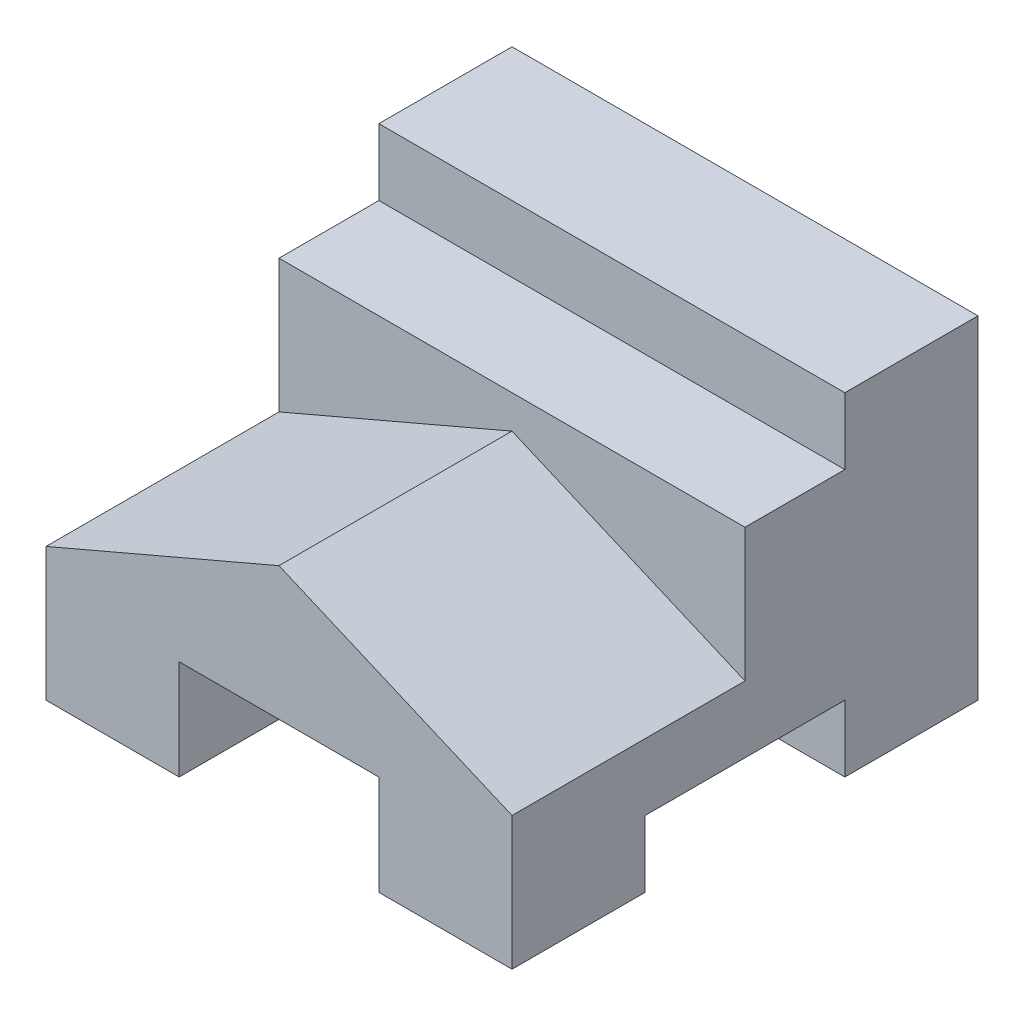
ISO-10303-21;
HEADER;
FILE_DESCRIPTION(('STEP AP214'),'2;1');
FILE_NAME('part.step','',(''),(''),'','','');
FILE_SCHEMA(('AUTOMOTIVE_DESIGN { 1 0 10303 214 1 1 1 1 }'));
ENDSEC;
DATA;
#1=APPLICATION_CONTEXT('core data for automotive mechanical design processes');
#2=APPLICATION_PROTOCOL_DEFINITION('international standard','automotive_design',2000,#1);
#3=PRODUCT_CONTEXT('',#1,'mechanical');
#4=PRODUCT('Part','Part','',(#3));
#5=PRODUCT_RELATED_PRODUCT_CATEGORY('part','',(#4));
#6=PRODUCT_DEFINITION_FORMATION('','',#4);
#7=PRODUCT_DEFINITION_CONTEXT('part definition',#1,'design');
#8=PRODUCT_DEFINITION('design','',#6,#7);
#9=PRODUCT_DEFINITION_SHAPE('','',#8);
#10=(LENGTH_UNIT() NAMED_UNIT(*) SI_UNIT(.MILLI.,.METRE.));
#11=(NAMED_UNIT(*) PLANE_ANGLE_UNIT() SI_UNIT($,.RADIAN.));
#12=(NAMED_UNIT(*) SI_UNIT($,.STERADIAN.) SOLID_ANGLE_UNIT());
#13=UNCERTAINTY_MEASURE_WITH_UNIT(LENGTH_MEASURE(1.E-05),#10,'distance_accuracy_value','');
#14=(GEOMETRIC_REPRESENTATION_CONTEXT(3) GLOBAL_UNCERTAINTY_ASSIGNED_CONTEXT((#13)) GLOBAL_UNIT_ASSIGNED_CONTEXT((#10,
#11,#12)) REPRESENTATION_CONTEXT('',''));
#15=CARTESIAN_POINT('',(0.,0.,0.));
#16=DIRECTION('',(0.,0.,1.));
#17=DIRECTION('',(1.,0.,0.));
#18=AXIS2_PLACEMENT_3D('',#15,#16,#17);
#19=CARTESIAN_POINT('',(-31.8772945789058,27.6908396946565,70.));
#20=DIRECTION('',(0.,-1.,0.));
#21=DIRECTION('',(0.,0.,-1.));
#22=AXIS2_PLACEMENT_3D('',#19,#20,#21);
#23=PLANE('',#22);
#24=DIRECTION('',(0.,0.,-1.));
#25=VECTOR('',#24,1.);
#26=CARTESIAN_POINT('',(-31.8772945789058,27.6908396946565,70.));
#27=LINE('',#26,#25);
#28=CARTESIAN_POINT('',(-31.8772945789058,27.6908396946565,20.));
#29=VERTEX_POINT('',#28);
#30=CARTESIAN_POINT('',(-31.8772945789058,27.6908396946565,0.));
#31=VERTEX_POINT('',#30);
#32=EDGE_CURVE('E195',#29,#31,#27,.T.);
#33=ORIENTED_EDGE('',*,*,#32,.F.);
#34=DIRECTION('',(-1.,0.,0.));
#35=VECTOR('',#34,1.);
#36=CARTESIAN_POINT('',(38.1227054210942,27.6908396946565,20.));
#37=LINE('',#36,#35);
#38=CARTESIAN_POINT('',(38.1227054210942,27.6908396946565,20.));
#39=VERTEX_POINT('',#38);
#40=EDGE_CURVE('E181',#39,#29,#37,.T.);
#41=ORIENTED_EDGE('',*,*,#40,.F.);
#42=DIRECTION('',(0.,0.,-1.));
#43=VECTOR('',#42,1.);
#44=CARTESIAN_POINT('',(38.1227054210942,27.6908396946565,70.));
#45=LINE('',#44,#43);
#46=CARTESIAN_POINT('',(38.1227054210942,27.6908396946565,0.));
#47=VERTEX_POINT('',#46);
#48=EDGE_CURVE('E193',#39,#47,#45,.T.);
#49=ORIENTED_EDGE('',*,*,#48,.T.);
#50=DIRECTION('',(-1.,0.,0.));
#51=VECTOR('',#50,1.);
#52=CARTESIAN_POINT('',(-31.8772945789058,27.6908396946565,0.));
#53=LINE('',#52,#51);
#54=EDGE_CURVE('E245',#47,#31,#53,.T.);
#55=ORIENTED_EDGE('',*,*,#54,.T.);
#56=EDGE_LOOP('',(#33,#41,#49,#55));
#57=FACE_BOUND('',#56,.T.);
#58=ADVANCED_FACE('F33',(#57),#23,.F.);
#59=CARTESIAN_POINT('',(-31.8772945789058,-22.3091603053435,70.));
#60=DIRECTION('',(0.,1.,0.));
#61=DIRECTION('',(0.,0.,1.));
#62=AXIS2_PLACEMENT_3D('',#59,#60,#61);
#63=PLANE('',#62);
#64=DIRECTION('',(1.,0.,0.));
#65=VECTOR('',#64,1.);
#66=CARTESIAN_POINT('',(-31.8772945789058,-22.3091603053435,0.));
#67=LINE('',#66,#65);
#68=CARTESIAN_POINT('',(-31.8772945789058,-22.3091603053435,0.));
#69=VERTEX_POINT('',#68);
#70=CARTESIAN_POINT('',(-11.8772945789058,-22.3091603053435,0.));
#71=VERTEX_POINT('',#70);
#72=EDGE_CURVE('E256',#69,#71,#67,.T.);
#73=ORIENTED_EDGE('',*,*,#72,.T.);
#74=DIRECTION('',(0.,0.,1.));
#75=VECTOR('',#74,1.);
#76=CARTESIAN_POINT('',(-11.8772945789058,-22.3091603053435,0.));
#77=LINE('',#76,#75);
#78=CARTESIAN_POINT('',(-11.8772945789058,-22.3091603053435,20.));
#79=VERTEX_POINT('',#78);
#80=EDGE_CURVE('E314',#71,#79,#77,.T.);
#81=ORIENTED_EDGE('',*,*,#80,.T.);
#82=DIRECTION('',(-1.,0.,0.));
#83=VECTOR('',#82,1.);
#84=CARTESIAN_POINT('',(38.1227054210942,-22.3091603053435,20.));
#85=LINE('',#84,#83);
#86=CARTESIAN_POINT('',(-31.8772945789058,-22.3091603053435,20.));
#87=VERTEX_POINT('',#86);
#88=EDGE_CURVE('E349',#79,#87,#85,.T.);
#89=ORIENTED_EDGE('',*,*,#88,.T.);
#90=DIRECTION('',(0.,0.,-1.));
#91=VECTOR('',#90,1.);
#92=CARTESIAN_POINT('',(-31.8772945789058,-22.3091603053435,70.));
#93=LINE('',#92,#91);
#94=EDGE_CURVE('E211',#87,#69,#93,.T.);
#95=ORIENTED_EDGE('',*,*,#94,.T.);
#96=EDGE_LOOP('',(#73,#81,#89,#95));
#97=FACE_BOUND('',#96,.T.);
#98=ADVANCED_FACE('F388',(#97),#63,.F.);
#99=DIRECTION('',(-1.,0.,0.));
#100=VECTOR('',#99,1.);
#101=CARTESIAN_POINT('',(38.1227054210942,-22.3091603053435,50.));
#102=LINE('',#101,#100);
#103=CARTESIAN_POINT('',(-11.8772945789058,-22.3091603053435,50.));
#104=VERTEX_POINT('',#103);
#105=CARTESIAN_POINT('',(-31.8772945789058,-22.3091603053435,50.));
#106=VERTEX_POINT('',#105);
#107=EDGE_CURVE('E241',#104,#106,#102,.T.);
#108=ORIENTED_EDGE('',*,*,#107,.F.);
#109=CARTESIAN_POINT('',(-11.8772945789058,-22.3091603053435,70.));
#110=VERTEX_POINT('',#109);
#111=EDGE_CURVE('E317',#104,#110,#77,.T.);
#112=ORIENTED_EDGE('',*,*,#111,.T.);
#113=DIRECTION('',(1.,0.,0.));
#114=VECTOR('',#113,1.);
#115=CARTESIAN_POINT('',(-31.8772945789058,-22.3091603053435,70.));
#116=LINE('',#115,#114);
#117=CARTESIAN_POINT('',(-31.8772945789058,-22.3091603053435,70.));
#118=VERTEX_POINT('',#117);
#119=EDGE_CURVE('E246',#118,#110,#116,.T.);
#120=ORIENTED_EDGE('',*,*,#119,.F.);
#121=EDGE_CURVE('E212',#118,#106,#93,.T.);
#122=ORIENTED_EDGE('',*,*,#121,.T.);
#123=EDGE_LOOP('',(#108,#112,#120,#122));
#124=FACE_BOUND('',#123,.T.);
#125=ADVANCED_FACE('F378',(#124),#63,.F.);
#126=CARTESIAN_POINT('',(38.1227054210942,-22.3091603053435,20.));
#127=DIRECTION('',(0.,0.,-1.));
#128=DIRECTION('',(-1.,0.,0.));
#129=AXIS2_PLACEMENT_3D('',#126,#127,#128);
#130=PLANE('',#129);
#131=ORIENTED_EDGE('',*,*,#88,.F.);
#132=DIRECTION('',(0.,1.,0.));
#133=VECTOR('',#132,1.);
#134=CARTESIAN_POINT('',(-11.8772945789058,-22.3091603053435,20.));
#135=LINE('',#134,#133);
#136=CARTESIAN_POINT('',(-11.8772945789058,-12.3091603053435,20.));
#137=VERTEX_POINT('',#136);
#138=EDGE_CURVE('E331',#79,#137,#135,.T.);
#139=ORIENTED_EDGE('',*,*,#138,.T.);
#140=DIRECTION('',(-1.,0.,0.));
#141=VECTOR('',#140,1.);
#142=CARTESIAN_POINT('',(38.1227054210942,-12.3091603053435,20.));
#143=LINE('',#142,#141);
#144=CARTESIAN_POINT('',(-31.8772945789058,-12.3091603053435,20.));
#145=VERTEX_POINT('',#144);
#146=EDGE_CURVE('E233',#137,#145,#143,.T.);
#147=ORIENTED_EDGE('',*,*,#146,.T.);
#148=DIRECTION('',(0.,-1.,0.));
#149=VECTOR('',#148,1.);
#150=CARTESIAN_POINT('',(-31.8772945789058,-22.3091603053435,20.));
#151=LINE('',#150,#149);
#152=EDGE_CURVE('E337',#145,#87,#151,.T.);
#153=ORIENTED_EDGE('',*,*,#152,.T.);
#154=EDGE_LOOP('',(#131,#139,#147,#153));
#155=FACE_BOUND('',#154,.T.);
#156=ADVANCED_FACE('F390',(#155),#130,.F.);
#157=CARTESIAN_POINT('',(38.1227054210942,-12.3091603053435,20.));
#158=DIRECTION('',(0.,1.,0.));
#159=DIRECTION('',(0.,0.,1.));
#160=AXIS2_PLACEMENT_3D('',#157,#158,#159);
#161=PLANE('',#160);
#162=ORIENTED_EDGE('',*,*,#146,.F.);
#163=DIRECTION('',(0.,0.,1.));
#164=VECTOR('',#163,1.);
#165=CARTESIAN_POINT('',(-11.8772945789058,-12.3091603053435,20.));
#166=LINE('',#165,#164);
#167=CARTESIAN_POINT('',(-11.8772945789058,-12.3091603053435,50.));
#168=VERTEX_POINT('',#167);
#169=EDGE_CURVE('E328',#137,#168,#166,.T.);
#170=ORIENTED_EDGE('',*,*,#169,.T.);
#171=DIRECTION('',(-1.,0.,0.));
#172=VECTOR('',#171,1.);
#173=CARTESIAN_POINT('',(38.1227054210942,-12.3091603053435,50.));
#174=LINE('',#173,#172);
#175=CARTESIAN_POINT('',(-31.8772945789058,-12.3091603053435,50.));
#176=VERTEX_POINT('',#175);
#177=EDGE_CURVE('E234',#168,#176,#174,.T.);
#178=ORIENTED_EDGE('',*,*,#177,.T.);
#179=DIRECTION('',(0.,0.,-1.));
#180=VECTOR('',#179,1.);
#181=CARTESIAN_POINT('',(-31.8772945789058,-12.3091603053435,20.));
#182=LINE('',#181,#180);
#183=EDGE_CURVE('E344',#176,#145,#182,.T.);
#184=ORIENTED_EDGE('',*,*,#183,.T.);
#185=EDGE_LOOP('',(#162,#170,#178,#184));
#186=FACE_BOUND('',#185,.T.);
#187=ADVANCED_FACE('F383',(#186),#161,.F.);
#188=CARTESIAN_POINT('',(38.1227054210942,-12.3091603053435,50.));
#189=DIRECTION('',(0.,0.,1.));
#190=DIRECTION('',(1.,0.,0.));
#191=AXIS2_PLACEMENT_3D('',#188,#189,#190);
#192=PLANE('',#191);
#193=ORIENTED_EDGE('',*,*,#177,.F.);
#194=DIRECTION('',(0.,-1.,0.));
#195=VECTOR('',#194,1.);
#196=CARTESIAN_POINT('',(-11.8772945789058,-12.3091603053435,50.));
#197=LINE('',#196,#195);
#198=EDGE_CURVE('E11',#168,#104,#197,.T.);
#199=ORIENTED_EDGE('',*,*,#198,.T.);
#200=ORIENTED_EDGE('',*,*,#107,.T.);
#201=DIRECTION('',(0.,1.,0.));
#202=VECTOR('',#201,1.);
#203=CARTESIAN_POINT('',(-31.8772945789058,-12.3091603053435,50.));
#204=LINE('',#203,#202);
#205=EDGE_CURVE('E334',#106,#176,#204,.T.);
#206=ORIENTED_EDGE('',*,*,#205,.T.);
#207=EDGE_LOOP('',(#193,#199,#200,#206));
#208=FACE_BOUND('',#207,.T.);
#209=ADVANCED_FACE('F377',(#208),#192,.F.);
#210=CARTESIAN_POINT('',(38.1227054210942,-22.3091603053435,20.));
#211=VERTEX_POINT('',#210);
#212=CARTESIAN_POINT('',(18.1227054210942,-22.3091603053435,20.));
#213=VERTEX_POINT('',#212);
#214=EDGE_CURVE('E255',#211,#213,#85,.T.);
#215=ORIENTED_EDGE('',*,*,#214,.T.);
#216=DIRECTION('',(0.,0.,1.));
#217=VECTOR('',#216,1.);
#218=CARTESIAN_POINT('',(18.1227054210942,-22.3091603053435,0.));
#219=LINE('',#218,#217);
#220=CARTESIAN_POINT('',(18.1227054210942,-22.3091603053435,0.));
#221=VERTEX_POINT('',#220);
#222=EDGE_CURVE('E322',#221,#213,#219,.T.);
#223=ORIENTED_EDGE('',*,*,#222,.F.);
#224=CARTESIAN_POINT('',(38.1227054210942,-22.3091603053435,0.));
#225=VERTEX_POINT('',#224);
#226=EDGE_CURVE('E254',#221,#225,#67,.T.);
#227=ORIENTED_EDGE('',*,*,#226,.T.);
#228=DIRECTION('',(0.,0.,-1.));
#229=VECTOR('',#228,1.);
#230=CARTESIAN_POINT('',(38.1227054210942,-22.3091603053435,70.));
#231=LINE('',#230,#229);
#232=EDGE_CURVE('E202',#211,#225,#231,.T.);
#233=ORIENTED_EDGE('',*,*,#232,.F.);
#234=EDGE_LOOP('',(#215,#223,#227,#233));
#235=FACE_BOUND('',#234,.T.);
#236=ADVANCED_FACE('F375',(#235),#63,.F.);
#237=CARTESIAN_POINT('',(-31.8772945789058,27.6908396946565,70.));
#238=DIRECTION('',(1.,0.,0.));
#239=DIRECTION('',(0.,0.,-1.));
#240=AXIS2_PLACEMENT_3D('',#237,#238,#239);
#241=PLANE('',#240);
#242=DIRECTION('',(0.,-1.,0.));
#243=VECTOR('',#242,1.);
#244=CARTESIAN_POINT('',(-31.8772945789058,-2.30916030534351,35.));
#245=LINE('',#244,#243);
#246=CARTESIAN_POINT('',(-31.8772945789058,17.6908396946565,35.));
#247=VERTEX_POINT('',#246);
#248=CARTESIAN_POINT('',(-31.8772945789058,-2.30916030534351,35.));
#249=VERTEX_POINT('',#248);
#250=EDGE_CURVE('E281',#247,#249,#245,.T.);
#251=ORIENTED_EDGE('',*,*,#250,.F.);
#252=DIRECTION('',(0.,0.,1.));
#253=VECTOR('',#252,1.);
#254=CARTESIAN_POINT('',(-31.8772945789058,17.6908396946565,35.));
#255=LINE('',#254,#253);
#256=CARTESIAN_POINT('',(-31.8772945789058,17.6908396946565,20.));
#257=VERTEX_POINT('',#256);
#258=EDGE_CURVE('E48',#257,#247,#255,.T.);
#259=ORIENTED_EDGE('',*,*,#258,.F.);
#260=DIRECTION('',(0.,-1.,0.));
#261=VECTOR('',#260,1.);
#262=CARTESIAN_POINT('',(-31.8772945789058,17.6908396946565,20.));
#263=LINE('',#262,#261);
#264=EDGE_CURVE('E269',#29,#257,#263,.T.);
#265=ORIENTED_EDGE('',*,*,#264,.F.);
#266=ORIENTED_EDGE('',*,*,#32,.T.);
#267=DIRECTION('',(0.,-1.,0.));
#268=VECTOR('',#267,1.);
#269=CARTESIAN_POINT('',(-31.8772945789058,27.6908396946565,0.));
#270=LINE('',#269,#268);
#271=EDGE_CURVE('E251',#31,#69,#270,.T.);
#272=ORIENTED_EDGE('',*,*,#271,.T.);
#273=ORIENTED_EDGE('',*,*,#94,.F.);
#274=ORIENTED_EDGE('',*,*,#152,.F.);
#275=ORIENTED_EDGE('',*,*,#183,.F.);
#276=ORIENTED_EDGE('',*,*,#205,.F.);
#277=ORIENTED_EDGE('',*,*,#121,.F.);
#278=DIRECTION('',(0.,-1.,0.));
#279=VECTOR('',#278,1.);
#280=CARTESIAN_POINT('',(-31.8772945789058,27.6908396946565,70.));
#281=LINE('',#280,#279);
#282=CARTESIAN_POINT('',(-31.8772945789058,-2.30916030534351,70.));
#283=VERTEX_POINT('',#282);
#284=EDGE_CURVE('E242',#283,#118,#281,.T.);
#285=ORIENTED_EDGE('',*,*,#284,.F.);
#286=DIRECTION('',(0.,0.,1.));
#287=VECTOR('',#286,1.);
#288=CARTESIAN_POINT('',(-31.8772945789058,-2.30916030534351,35.));
#289=LINE('',#288,#287);
#290=EDGE_CURVE('E56',#249,#283,#289,.T.);
#291=ORIENTED_EDGE('',*,*,#290,.F.);
#292=EDGE_LOOP('',(#251,#259,#265,#266,#272,#273,#274,#275,#276,#277,#285,#291));
#293=FACE_BOUND('',#292,.T.);
#294=ADVANCED_FACE('F35',(#293),#241,.F.);
#295=CARTESIAN_POINT('',(18.1227054210942,-22.3091603053435,70.));
#296=VERTEX_POINT('',#295);
#297=CARTESIAN_POINT('',(38.1227054210942,-22.3091603053435,70.));
#298=VERTEX_POINT('',#297);
#299=EDGE_CURVE('E244',#296,#298,#116,.T.);
#300=ORIENTED_EDGE('',*,*,#299,.F.);
#301=CARTESIAN_POINT('',(18.1227054210942,-22.3091603053435,50.));
#302=VERTEX_POINT('',#301);
#303=EDGE_CURVE('E307',#302,#296,#219,.T.);
#304=ORIENTED_EDGE('',*,*,#303,.F.);
#305=CARTESIAN_POINT('',(38.1227054210942,-22.3091603053435,50.));
#306=VERTEX_POINT('',#305);
#307=EDGE_CURVE('E223',#306,#302,#102,.T.);
#308=ORIENTED_EDGE('',*,*,#307,.F.);
#309=EDGE_CURVE('E204',#298,#306,#231,.T.);
#310=ORIENTED_EDGE('',*,*,#309,.F.);
#311=EDGE_LOOP('',(#300,#304,#308,#310));
#312=FACE_BOUND('',#311,.T.);
#313=ADVANCED_FACE('F362',(#312),#63,.F.);
#314=CARTESIAN_POINT('',(38.1227054210942,27.6908396946565,70.));
#315=DIRECTION('',(-1.,0.,0.));
#316=DIRECTION('',(0.,0.,1.));
#317=AXIS2_PLACEMENT_3D('',#314,#315,#316);
#318=PLANE('',#317);
#319=DIRECTION('',(0.,-1.,0.));
#320=VECTOR('',#319,1.);
#321=CARTESIAN_POINT('',(38.1227054210942,17.6908396946565,20.));
#322=LINE('',#321,#320);
#323=CARTESIAN_POINT('',(38.1227054210942,17.6908396946565,20.));
#324=VERTEX_POINT('',#323);
#325=EDGE_CURVE('E177',#39,#324,#322,.T.);
#326=ORIENTED_EDGE('',*,*,#325,.T.);
#327=DIRECTION('',(0.,0.,1.));
#328=VECTOR('',#327,1.);
#329=CARTESIAN_POINT('',(38.1227054210942,17.6908396946565,35.));
#330=LINE('',#329,#328);
#331=CARTESIAN_POINT('',(38.1227054210942,17.6908396946565,35.));
#332=VERTEX_POINT('',#331);
#333=EDGE_CURVE('E188',#324,#332,#330,.T.);
#334=ORIENTED_EDGE('',*,*,#333,.T.);
#335=DIRECTION('',(0.,1.,0.));
#336=VECTOR('',#335,1.);
#337=CARTESIAN_POINT('',(38.1227054210942,27.6908396946565,35.));
#338=LINE('',#337,#336);
#339=CARTESIAN_POINT('',(38.1227054210942,-2.30916030534351,35.));
#340=VERTEX_POINT('',#339);
#341=EDGE_CURVE('E278',#340,#332,#338,.T.);
#342=ORIENTED_EDGE('',*,*,#341,.F.);
#343=DIRECTION('',(0.,0.,1.));
#344=VECTOR('',#343,1.);
#345=CARTESIAN_POINT('',(38.1227054210942,-2.30916030534351,35.));
#346=LINE('',#345,#344);
#347=CARTESIAN_POINT('',(38.1227054210942,-2.30916030534351,70.));
#348=VERTEX_POINT('',#347);
#349=EDGE_CURVE('E292',#340,#348,#346,.T.);
#350=ORIENTED_EDGE('',*,*,#349,.T.);
#351=DIRECTION('',(0.,1.,0.));
#352=VECTOR('',#351,1.);
#353=CARTESIAN_POINT('',(38.1227054210942,27.6908396946565,70.));
#354=LINE('',#353,#352);
#355=EDGE_CURVE('E206',#298,#348,#354,.T.);
#356=ORIENTED_EDGE('',*,*,#355,.F.);
#357=ORIENTED_EDGE('',*,*,#309,.T.);
#358=DIRECTION('',(0.,1.,0.));
#359=VECTOR('',#358,1.);
#360=CARTESIAN_POINT('',(38.1227054210942,-12.3091603053435,50.));
#361=LINE('',#360,#359);
#362=CARTESIAN_POINT('',(38.1227054210942,-12.3091603053435,50.));
#363=VERTEX_POINT('',#362);
#364=EDGE_CURVE('E335',#306,#363,#361,.T.);
#365=ORIENTED_EDGE('',*,*,#364,.T.);
#366=DIRECTION('',(0.,0.,-1.));
#367=VECTOR('',#366,1.);
#368=CARTESIAN_POINT('',(38.1227054210942,-12.3091603053435,20.));
#369=LINE('',#368,#367);
#370=CARTESIAN_POINT('',(38.1227054210942,-12.3091603053435,20.));
#371=VERTEX_POINT('',#370);
#372=EDGE_CURVE('E232',#363,#371,#369,.T.);
#373=ORIENTED_EDGE('',*,*,#372,.T.);
#374=DIRECTION('',(0.,-1.,0.));
#375=VECTOR('',#374,1.);
#376=CARTESIAN_POINT('',(38.1227054210942,-22.3091603053435,20.));
#377=LINE('',#376,#375);
#378=EDGE_CURVE('E339',#371,#211,#377,.T.);
#379=ORIENTED_EDGE('',*,*,#378,.T.);
#380=ORIENTED_EDGE('',*,*,#232,.T.);
#381=DIRECTION('',(0.,1.,0.));
#382=VECTOR('',#381,1.);
#383=CARTESIAN_POINT('',(38.1227054210942,27.6908396946565,0.));
#384=LINE('',#383,#382);
#385=EDGE_CURVE('E200',#225,#47,#384,.T.);
#386=ORIENTED_EDGE('',*,*,#385,.T.);
#387=ORIENTED_EDGE('',*,*,#48,.F.);
#388=EDGE_LOOP('',(#326,#334,#342,#350,#356,#357,#365,#373,#379,#380,#386,#387));
#389=FACE_BOUND('',#388,.T.);
#390=ADVANCED_FACE('F197',(#389),#318,.F.);
#391=CARTESIAN_POINT('',(0.,0.,70.));
#392=DIRECTION('',(0.,0.,1.));
#393=DIRECTION('',(1.,0.,0.));
#394=AXIS2_PLACEMENT_3D('',#391,#392,#393);
#395=PLANE('',#394);
#396=DIRECTION('',(0.919145030018058,-0.393919298579168,0.));
#397=VECTOR('',#396,1.);
#398=CARTESIAN_POINT('',(38.1227054210942,-2.30916030534351,70.));
#399=LINE('',#398,#397);
#400=CARTESIAN_POINT('',(3.12270542109422,12.6908396946565,70.));
#401=VERTEX_POINT('',#400);
#402=EDGE_CURVE('E282',#401,#348,#399,.T.);
#403=ORIENTED_EDGE('',*,*,#402,.F.);
#404=DIRECTION('',(0.919145030018058,0.393919298579168,0.));
#405=VECTOR('',#404,1.);
#406=CARTESIAN_POINT('',(3.12270542109422,12.6908396946565,70.));
#407=LINE('',#406,#405);
#408=EDGE_CURVE('E276',#283,#401,#407,.T.);
#409=ORIENTED_EDGE('',*,*,#408,.F.);
#410=ORIENTED_EDGE('',*,*,#284,.T.);
#411=ORIENTED_EDGE('',*,*,#119,.T.);
#412=DIRECTION('',(0.,-1.,0.));
#413=VECTOR('',#412,1.);
#414=CARTESIAN_POINT('',(-11.8772945789058,-22.3091603053435,70.));
#415=LINE('',#414,#413);
#416=CARTESIAN_POINT('',(-11.8772945789058,-7.30916030534351,70.));
#417=VERTEX_POINT('',#416);
#418=EDGE_CURVE('E303',#417,#110,#415,.T.);
#419=ORIENTED_EDGE('',*,*,#418,.F.);
#420=DIRECTION('',(-1.,0.,0.));
#421=VECTOR('',#420,1.);
#422=CARTESIAN_POINT('',(-11.8772945789058,-7.30916030534351,70.));
#423=LINE('',#422,#421);
#424=CARTESIAN_POINT('',(18.1227054210942,-7.30916030534351,70.));
#425=VERTEX_POINT('',#424);
#426=EDGE_CURVE('E310',#425,#417,#423,.T.);
#427=ORIENTED_EDGE('',*,*,#426,.F.);
#428=DIRECTION('',(0.,1.,0.));
#429=VECTOR('',#428,1.);
#430=CARTESIAN_POINT('',(18.1227054210942,-7.30916030534351,70.));
#431=LINE('',#430,#429);
#432=EDGE_CURVE('E295',#296,#425,#431,.T.);
#433=ORIENTED_EDGE('',*,*,#432,.F.);
#434=ORIENTED_EDGE('',*,*,#299,.T.);
#435=ORIENTED_EDGE('',*,*,#355,.T.);
#436=EDGE_LOOP('',(#403,#409,#410,#411,#419,#427,#433,#434,#435));
#437=FACE_BOUND('',#436,.T.);
#438=ADVANCED_FACE('F368',(#437),#395,.T.);
#439=CARTESIAN_POINT('',(0.,0.,0.));
#440=DIRECTION('',(0.,0.,1.));
#441=DIRECTION('',(1.,0.,0.));
#442=AXIS2_PLACEMENT_3D('',#439,#440,#441);
#443=PLANE('',#442);
#444=DIRECTION('',(-1.,0.,0.));
#445=VECTOR('',#444,1.);
#446=CARTESIAN_POINT('',(-11.8772945789058,-7.30916030534351,0.));
#447=LINE('',#446,#445);
#448=CARTESIAN_POINT('',(18.1227054210942,-7.30916030534351,0.));
#449=VERTEX_POINT('',#448);
#450=CARTESIAN_POINT('',(-11.8772945789058,-7.30916030534351,0.));
#451=VERTEX_POINT('',#450);
#452=EDGE_CURVE('E302',#449,#451,#447,.T.);
#453=ORIENTED_EDGE('',*,*,#452,.T.);
#454=DIRECTION('',(0.,-1.,0.));
#455=VECTOR('',#454,1.);
#456=CARTESIAN_POINT('',(-11.8772945789058,-22.3091603053435,0.));
#457=LINE('',#456,#455);
#458=EDGE_CURVE('E305',#451,#71,#457,.T.);
#459=ORIENTED_EDGE('',*,*,#458,.T.);
#460=ORIENTED_EDGE('',*,*,#72,.F.);
#461=ORIENTED_EDGE('',*,*,#271,.F.);
#462=ORIENTED_EDGE('',*,*,#54,.F.);
#463=ORIENTED_EDGE('',*,*,#385,.F.);
#464=ORIENTED_EDGE('',*,*,#226,.F.);
#465=DIRECTION('',(0.,1.,0.));
#466=VECTOR('',#465,1.);
#467=CARTESIAN_POINT('',(18.1227054210942,-7.30916030534351,0.));
#468=LINE('',#467,#466);
#469=EDGE_CURVE('E299',#221,#449,#468,.T.);
#470=ORIENTED_EDGE('',*,*,#469,.T.);
#471=EDGE_LOOP('',(#453,#459,#460,#461,#462,#463,#464,#470));
#472=FACE_BOUND('',#471,.T.);
#473=ADVANCED_FACE('F263',(#472),#443,.F.);
#474=CARTESIAN_POINT('',(18.1227054210942,-12.3091603053435,20.));
#475=VERTEX_POINT('',#474);
#476=EDGE_CURVE('E236',#371,#475,#143,.T.);
#477=ORIENTED_EDGE('',*,*,#476,.T.);
#478=DIRECTION('',(0.,-1.,0.));
#479=VECTOR('',#478,1.);
#480=CARTESIAN_POINT('',(18.1227054210942,-22.3091603053435,20.));
#481=LINE('',#480,#479);
#482=EDGE_CURVE('E325',#475,#213,#481,.T.);
#483=ORIENTED_EDGE('',*,*,#482,.T.);
#484=ORIENTED_EDGE('',*,*,#214,.F.);
#485=ORIENTED_EDGE('',*,*,#378,.F.);
#486=EDGE_LOOP('',(#477,#483,#484,#485));
#487=FACE_BOUND('',#486,.T.);
#488=ADVANCED_FACE('F357',(#487),#130,.F.);
#489=CARTESIAN_POINT('',(18.1227054210942,-12.3091603053435,50.));
#490=VERTEX_POINT('',#489);
#491=EDGE_CURVE('E220',#363,#490,#174,.T.);
#492=ORIENTED_EDGE('',*,*,#491,.T.);
#493=DIRECTION('',(0.,0.,-1.));
#494=VECTOR('',#493,1.);
#495=CARTESIAN_POINT('',(18.1227054210942,-12.3091603053435,20.));
#496=LINE('',#495,#494);
#497=EDGE_CURVE('E229',#490,#475,#496,.T.);
#498=ORIENTED_EDGE('',*,*,#497,.T.);
#499=ORIENTED_EDGE('',*,*,#476,.F.);
#500=ORIENTED_EDGE('',*,*,#372,.F.);
#501=EDGE_LOOP('',(#492,#498,#499,#500));
#502=FACE_BOUND('',#501,.T.);
#503=ADVANCED_FACE('F228',(#502),#161,.F.);
#504=ORIENTED_EDGE('',*,*,#307,.T.);
#505=DIRECTION('',(0.,1.,0.));
#506=VECTOR('',#505,1.);
#507=CARTESIAN_POINT('',(18.1227054210942,-12.3091603053435,50.));
#508=LINE('',#507,#506);
#509=EDGE_CURVE('E41',#302,#490,#508,.T.);
#510=ORIENTED_EDGE('',*,*,#509,.T.);
#511=ORIENTED_EDGE('',*,*,#491,.F.);
#512=ORIENTED_EDGE('',*,*,#364,.F.);
#513=EDGE_LOOP('',(#504,#510,#511,#512));
#514=FACE_BOUND('',#513,.T.);
#515=ADVANCED_FACE('F219',(#514),#192,.F.);
#516=CARTESIAN_POINT('',(-11.8772945789058,-22.3091603053435,0.));
#517=DIRECTION('',(-1.,0.,0.));
#518=DIRECTION('',(0.,0.,1.));
#519=AXIS2_PLACEMENT_3D('',#516,#517,#518);
#520=PLANE('',#519);
#521=ORIENTED_EDGE('',*,*,#80,.F.);
#522=ORIENTED_EDGE('',*,*,#458,.F.);
#523=DIRECTION('',(0.,0.,1.));
#524=VECTOR('',#523,1.);
#525=CARTESIAN_POINT('',(-11.8772945789058,-7.30916030534351,0.));
#526=LINE('',#525,#524);
#527=EDGE_CURVE('E318',#451,#417,#526,.T.);
#528=ORIENTED_EDGE('',*,*,#527,.T.);
#529=ORIENTED_EDGE('',*,*,#418,.T.);
#530=ORIENTED_EDGE('',*,*,#111,.F.);
#531=ORIENTED_EDGE('',*,*,#198,.F.);
#532=ORIENTED_EDGE('',*,*,#169,.F.);
#533=ORIENTED_EDGE('',*,*,#138,.F.);
#534=EDGE_LOOP('',(#521,#522,#528,#529,#530,#531,#532,#533));
#535=FACE_BOUND('',#534,.T.);
#536=ADVANCED_FACE('F408',(#535),#520,.F.);
#537=CARTESIAN_POINT('',(18.1227054210942,-7.30916030534351,0.));
#538=DIRECTION('',(1.,0.,0.));
#539=DIRECTION('',(0.,0.,-1.));
#540=AXIS2_PLACEMENT_3D('',#537,#538,#539);
#541=PLANE('',#540);
#542=ORIENTED_EDGE('',*,*,#497,.F.);
#543=ORIENTED_EDGE('',*,*,#509,.F.);
#544=ORIENTED_EDGE('',*,*,#303,.T.);
#545=ORIENTED_EDGE('',*,*,#432,.T.);
#546=DIRECTION('',(0.,0.,1.));
#547=VECTOR('',#546,1.);
#548=CARTESIAN_POINT('',(18.1227054210942,-7.30916030534351,0.));
#549=LINE('',#548,#547);
#550=EDGE_CURVE('E320',#449,#425,#549,.T.);
#551=ORIENTED_EDGE('',*,*,#550,.F.);
#552=ORIENTED_EDGE('',*,*,#469,.F.);
#553=ORIENTED_EDGE('',*,*,#222,.T.);
#554=ORIENTED_EDGE('',*,*,#482,.F.);
#555=EDGE_LOOP('',(#542,#543,#544,#545,#551,#552,#553,#554));
#556=FACE_BOUND('',#555,.T.);
#557=ADVANCED_FACE('F364',(#556),#541,.F.);
#558=CARTESIAN_POINT('',(-11.8772945789058,-7.30916030534351,0.));
#559=DIRECTION('',(0.,1.,0.));
#560=DIRECTION('',(0.,0.,1.));
#561=AXIS2_PLACEMENT_3D('',#558,#559,#560);
#562=PLANE('',#561);
#563=ORIENTED_EDGE('',*,*,#426,.T.);
#564=ORIENTED_EDGE('',*,*,#527,.F.);
#565=ORIENTED_EDGE('',*,*,#452,.F.);
#566=ORIENTED_EDGE('',*,*,#550,.T.);
#567=EDGE_LOOP('',(#563,#564,#565,#566));
#568=FACE_BOUND('',#567,.T.);
#569=ADVANCED_FACE('F371',(#568),#562,.F.);
#570=CARTESIAN_POINT('',(38.1227054210942,-2.30916030534351,35.));
#571=DIRECTION('',(-0.393919298579168,-0.919145030018058,0.));
#572=DIRECTION('',(0.919145030018058,-0.393919298579168,0.));
#573=AXIS2_PLACEMENT_3D('',#570,#571,#572);
#574=PLANE('',#573);
#575=ORIENTED_EDGE('',*,*,#402,.T.);
#576=ORIENTED_EDGE('',*,*,#349,.F.);
#577=DIRECTION('',(0.919145030018058,-0.393919298579168,0.));
#578=VECTOR('',#577,1.);
#579=CARTESIAN_POINT('',(38.1227054210942,-2.30916030534351,35.));
#580=LINE('',#579,#578);
#581=CARTESIAN_POINT('',(3.12270542109422,12.6908396946565,35.));
#582=VERTEX_POINT('',#581);
#583=EDGE_CURVE('E287',#582,#340,#580,.T.);
#584=ORIENTED_EDGE('',*,*,#583,.F.);
#585=DIRECTION('',(0.,0.,1.));
#586=VECTOR('',#585,1.);
#587=CARTESIAN_POINT('',(3.12270542109422,12.6908396946565,35.));
#588=LINE('',#587,#586);
#589=EDGE_CURVE('E296',#582,#401,#588,.T.);
#590=ORIENTED_EDGE('',*,*,#589,.T.);
#591=EDGE_LOOP('',(#575,#576,#584,#590));
#592=FACE_BOUND('',#591,.T.);
#593=ADVANCED_FACE('F417',(#592),#574,.F.);
#594=CARTESIAN_POINT('',(3.12270542109422,12.6908396946565,35.));
#595=DIRECTION('',(0.393919298579168,-0.919145030018058,0.));
#596=DIRECTION('',(0.919145030018058,0.393919298579168,0.));
#597=AXIS2_PLACEMENT_3D('',#594,#595,#596);
#598=PLANE('',#597);
#599=ORIENTED_EDGE('',*,*,#408,.T.);
#600=ORIENTED_EDGE('',*,*,#589,.F.);
#601=DIRECTION('',(0.919145030018058,0.393919298579168,0.));
#602=VECTOR('',#601,1.);
#603=CARTESIAN_POINT('',(3.12270542109422,12.6908396946565,35.));
#604=LINE('',#603,#602);
#605=EDGE_CURVE('E284',#249,#582,#604,.T.);
#606=ORIENTED_EDGE('',*,*,#605,.F.);
#607=ORIENTED_EDGE('',*,*,#290,.T.);
#608=EDGE_LOOP('',(#599,#600,#606,#607));
#609=FACE_BOUND('',#608,.T.);
#610=ADVANCED_FACE('F421',(#609),#598,.F.);
#611=CARTESIAN_POINT('',(0.,0.,35.));
#612=DIRECTION('',(0.,0.,1.));
#613=DIRECTION('',(1.,0.,0.));
#614=AXIS2_PLACEMENT_3D('',#611,#612,#613);
#615=PLANE('',#614);
#616=DIRECTION('',(-1.,0.,0.));
#617=VECTOR('',#616,1.);
#618=CARTESIAN_POINT('',(38.1227054210942,17.6908396946565,35.));
#619=LINE('',#618,#617);
#620=EDGE_CURVE('E274',#332,#247,#619,.T.);
#621=ORIENTED_EDGE('',*,*,#620,.T.);
#622=ORIENTED_EDGE('',*,*,#250,.T.);
#623=ORIENTED_EDGE('',*,*,#605,.T.);
#624=ORIENTED_EDGE('',*,*,#583,.T.);
#625=ORIENTED_EDGE('',*,*,#341,.T.);
#626=EDGE_LOOP('',(#621,#622,#623,#624,#625));
#627=FACE_BOUND('',#626,.T.);
#628=ADVANCED_FACE('F424',(#627),#615,.T.);
#629=CARTESIAN_POINT('',(38.1227054210942,17.6908396946565,35.));
#630=DIRECTION('',(0.,-1.,0.));
#631=DIRECTION('',(0.,0.,-1.));
#632=AXIS2_PLACEMENT_3D('',#629,#630,#631);
#633=PLANE('',#632);
#634=ORIENTED_EDGE('',*,*,#258,.T.);
#635=ORIENTED_EDGE('',*,*,#620,.F.);
#636=ORIENTED_EDGE('',*,*,#333,.F.);
#637=DIRECTION('',(-1.,0.,0.));
#638=VECTOR('',#637,1.);
#639=CARTESIAN_POINT('',(38.1227054210942,17.6908396946565,20.));
#640=LINE('',#639,#638);
#641=EDGE_CURVE('E183',#324,#257,#640,.T.);
#642=ORIENTED_EDGE('',*,*,#641,.T.);
#643=EDGE_LOOP('',(#634,#635,#636,#642));
#644=FACE_BOUND('',#643,.T.);
#645=ADVANCED_FACE('F430',(#644),#633,.F.);
#646=CARTESIAN_POINT('',(38.1227054210942,17.6908396946565,20.));
#647=DIRECTION('',(0.,0.,-1.));
#648=DIRECTION('',(-1.,0.,0.));
#649=AXIS2_PLACEMENT_3D('',#646,#647,#648);
#650=PLANE('',#649);
#651=ORIENTED_EDGE('',*,*,#264,.T.);
#652=ORIENTED_EDGE('',*,*,#641,.F.);
#653=ORIENTED_EDGE('',*,*,#325,.F.);
#654=ORIENTED_EDGE('',*,*,#40,.T.);
#655=EDGE_LOOP('',(#651,#652,#653,#654));
#656=FACE_BOUND('',#655,.T.);
#657=ADVANCED_FACE('F180',(#656),#650,.F.);
#658=CLOSED_SHELL('',(#58,#98,#125,#156,#187,#209,#236,#294,#313,#390,#438,#473,#488,#503,#515,
#536,#557,#569,#593,#610,#628,#645,#657));
#659=MANIFOLD_SOLID_BREP('B2',#658);
#660=ADVANCED_BREP_SHAPE_REPRESENTATION('',(#18,#659),#14);
#661=SHAPE_DEFINITION_REPRESENTATION(#9,#660);
ENDSEC;
END-ISO-10303-21;
